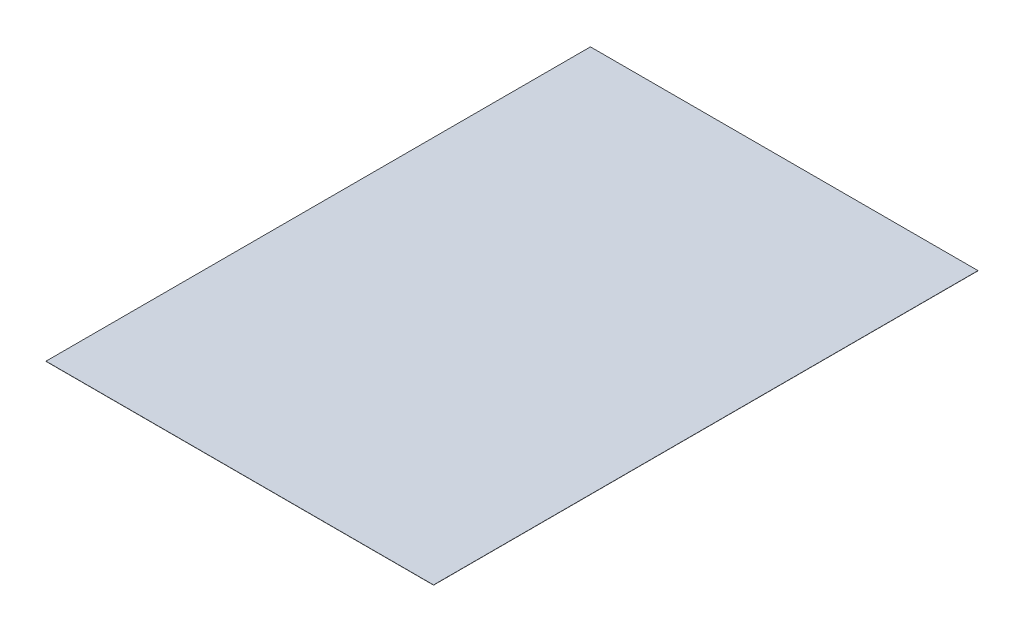
ISO-10303-21;
HEADER;
FILE_DESCRIPTION(('STEP AP214'),'2;1');
FILE_NAME('part.step','',(''),(''),'','','');
FILE_SCHEMA(('AUTOMOTIVE_DESIGN { 1 0 10303 214 1 1 1 1 }'));
ENDSEC;
DATA;
#1=APPLICATION_CONTEXT('core data for automotive mechanical design processes');
#2=APPLICATION_PROTOCOL_DEFINITION('international standard','automotive_design',2000,#1);
#3=PRODUCT_CONTEXT('',#1,'mechanical');
#4=PRODUCT('Part','Part','',(#3));
#5=PRODUCT_RELATED_PRODUCT_CATEGORY('part','',(#4));
#6=PRODUCT_DEFINITION_FORMATION('','',#4);
#7=PRODUCT_DEFINITION_CONTEXT('part definition',#1,'design');
#8=PRODUCT_DEFINITION('design','',#6,#7);
#9=PRODUCT_DEFINITION_SHAPE('','',#8);
#10=(LENGTH_UNIT() NAMED_UNIT(*) SI_UNIT(.MILLI.,.METRE.));
#11=(NAMED_UNIT(*) PLANE_ANGLE_UNIT() SI_UNIT($,.RADIAN.));
#12=(NAMED_UNIT(*) SI_UNIT($,.STERADIAN.) SOLID_ANGLE_UNIT());
#13=UNCERTAINTY_MEASURE_WITH_UNIT(LENGTH_MEASURE(1.E-05),#10,'distance_accuracy_value','');
#14=(GEOMETRIC_REPRESENTATION_CONTEXT(3) GLOBAL_UNCERTAINTY_ASSIGNED_CONTEXT((#13)) GLOBAL_UNIT_ASSIGNED_CONTEXT((#10,
#11,#12)) REPRESENTATION_CONTEXT('',''));
#15=CARTESIAN_POINT('',(0.,0.,0.));
#16=DIRECTION('',(0.,0.,1.));
#17=DIRECTION('',(1.,0.,0.));
#18=AXIS2_PLACEMENT_3D('',#15,#16,#17);
#19=CARTESIAN_POINT('',(0.,0.1,0.));
#20=DIRECTION('',(1.,0.,0.));
#21=DIRECTION('',(0.,0.,-1.));
#22=AXIS2_PLACEMENT_3D('',#19,#20,#21);
#23=PLANE('',#22);
#24=DIRECTION('',(0.,0.,1.));
#25=VECTOR('',#24,1.);
#26=CARTESIAN_POINT('',(0.,0.,0.));
#27=LINE('',#26,#25);
#28=CARTESIAN_POINT('',(0.,0.,-295.));
#29=VERTEX_POINT('',#28);
#30=CARTESIAN_POINT('',(0.,0.,0.));
#31=VERTEX_POINT('',#30);
#32=EDGE_CURVE('E95',#29,#31,#27,.T.);
#33=ORIENTED_EDGE('',*,*,#32,.T.);
#34=DIRECTION('',(0.,-1.,0.));
#35=VECTOR('',#34,1.);
#36=CARTESIAN_POINT('',(0.,0.1,0.));
#37=LINE('',#36,#35);
#38=CARTESIAN_POINT('',(0.,0.1,0.));
#39=VERTEX_POINT('',#38);
#40=EDGE_CURVE('E11',#39,#31,#37,.T.);
#41=ORIENTED_EDGE('',*,*,#40,.F.);
#42=DIRECTION('',(0.,0.,1.));
#43=VECTOR('',#42,1.);
#44=CARTESIAN_POINT('',(0.,0.1,0.));
#45=LINE('',#44,#43);
#46=CARTESIAN_POINT('',(0.,0.1,-295.));
#47=VERTEX_POINT('',#46);
#48=EDGE_CURVE('E83',#47,#39,#45,.T.);
#49=ORIENTED_EDGE('',*,*,#48,.F.);
#50=DIRECTION('',(0.,-1.,0.));
#51=VECTOR('',#50,1.);
#52=CARTESIAN_POINT('',(0.,0.1,-295.));
#53=LINE('',#52,#51);
#54=EDGE_CURVE('E91',#47,#29,#53,.T.);
#55=ORIENTED_EDGE('',*,*,#54,.T.);
#56=EDGE_LOOP('',(#33,#41,#49,#55));
#57=FACE_BOUND('',#56,.T.);
#58=ADVANCED_FACE('F32',(#57),#23,.F.);
#59=CARTESIAN_POINT('',(0.,0.1,0.));
#60=DIRECTION('',(0.,0.,-1.));
#61=DIRECTION('',(-1.,0.,0.));
#62=AXIS2_PLACEMENT_3D('',#59,#60,#61);
#63=PLANE('',#62);
#64=DIRECTION('',(1.,0.,0.));
#65=VECTOR('',#64,1.);
#66=CARTESIAN_POINT('',(0.,0.,0.));
#67=LINE('',#66,#65);
#68=CARTESIAN_POINT('',(210.,0.,0.));
#69=VERTEX_POINT('',#68);
#70=EDGE_CURVE('E87',#31,#69,#67,.T.);
#71=ORIENTED_EDGE('',*,*,#70,.T.);
#72=DIRECTION('',(0.,-1.,0.));
#73=VECTOR('',#72,1.);
#74=CARTESIAN_POINT('',(210.,0.1,0.));
#75=LINE('',#74,#73);
#76=CARTESIAN_POINT('',(210.,0.1,0.));
#77=VERTEX_POINT('',#76);
#78=EDGE_CURVE('E40',#77,#69,#75,.T.);
#79=ORIENTED_EDGE('',*,*,#78,.F.);
#80=DIRECTION('',(1.,0.,0.));
#81=VECTOR('',#80,1.);
#82=CARTESIAN_POINT('',(0.,0.1,0.));
#83=LINE('',#82,#81);
#84=EDGE_CURVE('E78',#39,#77,#83,.T.);
#85=ORIENTED_EDGE('',*,*,#84,.F.);
#86=ORIENTED_EDGE('',*,*,#40,.T.);
#87=EDGE_LOOP('',(#71,#79,#85,#86));
#88=FACE_BOUND('',#87,.T.);
#89=ADVANCED_FACE('F86',(#88),#63,.F.);
#90=CARTESIAN_POINT('',(210.,0.1,0.));
#91=DIRECTION('',(-1.,0.,0.));
#92=DIRECTION('',(0.,0.,1.));
#93=AXIS2_PLACEMENT_3D('',#90,#91,#92);
#94=PLANE('',#93);
#95=DIRECTION('',(0.,0.,-1.));
#96=VECTOR('',#95,1.);
#97=CARTESIAN_POINT('',(210.,0.,0.));
#98=LINE('',#97,#96);
#99=CARTESIAN_POINT('',(210.,0.,-295.));
#100=VERTEX_POINT('',#99);
#101=EDGE_CURVE('E65',#69,#100,#98,.T.);
#102=ORIENTED_EDGE('',*,*,#101,.T.);
#103=DIRECTION('',(0.,-1.,0.));
#104=VECTOR('',#103,1.);
#105=CARTESIAN_POINT('',(210.,0.1,-295.));
#106=LINE('',#105,#104);
#107=CARTESIAN_POINT('',(210.,0.1,-295.));
#108=VERTEX_POINT('',#107);
#109=EDGE_CURVE('E88',#108,#100,#106,.T.);
#110=ORIENTED_EDGE('',*,*,#109,.F.);
#111=DIRECTION('',(0.,0.,-1.));
#112=VECTOR('',#111,1.);
#113=CARTESIAN_POINT('',(210.,0.1,0.));
#114=LINE('',#113,#112);
#115=EDGE_CURVE('E81',#77,#108,#114,.T.);
#116=ORIENTED_EDGE('',*,*,#115,.F.);
#117=ORIENTED_EDGE('',*,*,#78,.T.);
#118=EDGE_LOOP('',(#102,#110,#116,#117));
#119=FACE_BOUND('',#118,.T.);
#120=ADVANCED_FACE('F89',(#119),#94,.F.);
#121=CARTESIAN_POINT('',(0.,0.1,-295.));
#122=DIRECTION('',(0.,0.,1.));
#123=DIRECTION('',(1.,0.,0.));
#124=AXIS2_PLACEMENT_3D('',#121,#122,#123);
#125=PLANE('',#124);
#126=DIRECTION('',(-1.,0.,0.));
#127=VECTOR('',#126,1.);
#128=CARTESIAN_POINT('',(0.,0.,-295.));
#129=LINE('',#128,#127);
#130=EDGE_CURVE('E71',#100,#29,#129,.T.);
#131=ORIENTED_EDGE('',*,*,#130,.T.);
#132=ORIENTED_EDGE('',*,*,#54,.F.);
#133=DIRECTION('',(-1.,0.,0.));
#134=VECTOR('',#133,1.);
#135=CARTESIAN_POINT('',(0.,0.1,-295.));
#136=LINE('',#135,#134);
#137=EDGE_CURVE('E48',#108,#47,#136,.T.);
#138=ORIENTED_EDGE('',*,*,#137,.F.);
#139=ORIENTED_EDGE('',*,*,#109,.T.);
#140=EDGE_LOOP('',(#131,#132,#138,#139));
#141=FACE_BOUND('',#140,.T.);
#142=ADVANCED_FACE('F102',(#141),#125,.F.);
#143=CARTESIAN_POINT('',(0.,0.1,0.));
#144=DIRECTION('',(0.,-1.,0.));
#145=DIRECTION('',(0.,0.,-1.));
#146=AXIS2_PLACEMENT_3D('',#143,#144,#145);
#147=PLANE('',#146);
#148=ORIENTED_EDGE('',*,*,#48,.T.);
#149=ORIENTED_EDGE('',*,*,#84,.T.);
#150=ORIENTED_EDGE('',*,*,#115,.T.);
#151=ORIENTED_EDGE('',*,*,#137,.T.);
#152=EDGE_LOOP('',(#148,#149,#150,#151));
#153=FACE_BOUND('',#152,.T.);
#154=ADVANCED_FACE('F79',(#153),#147,.F.);
#155=CARTESIAN_POINT('',(0.,0.,0.));
#156=DIRECTION('',(0.,-1.,0.));
#157=DIRECTION('',(0.,0.,-1.));
#158=AXIS2_PLACEMENT_3D('',#155,#156,#157);
#159=PLANE('',#158);
#160=ORIENTED_EDGE('',*,*,#32,.F.);
#161=ORIENTED_EDGE('',*,*,#130,.F.);
#162=ORIENTED_EDGE('',*,*,#101,.F.);
#163=ORIENTED_EDGE('',*,*,#70,.F.);
#164=EDGE_LOOP('',(#160,#161,#162,#163));
#165=FACE_BOUND('',#164,.T.);
#166=ADVANCED_FACE('F105',(#165),#159,.T.);
#167=CLOSED_SHELL('',(#58,#89,#120,#142,#154,#166));
#168=MANIFOLD_SOLID_BREP('B2',#167);
#169=ADVANCED_BREP_SHAPE_REPRESENTATION('',(#18,#168),#14);
#170=SHAPE_DEFINITION_REPRESENTATION(#9,#169);
ENDSEC;
END-ISO-10303-21;
